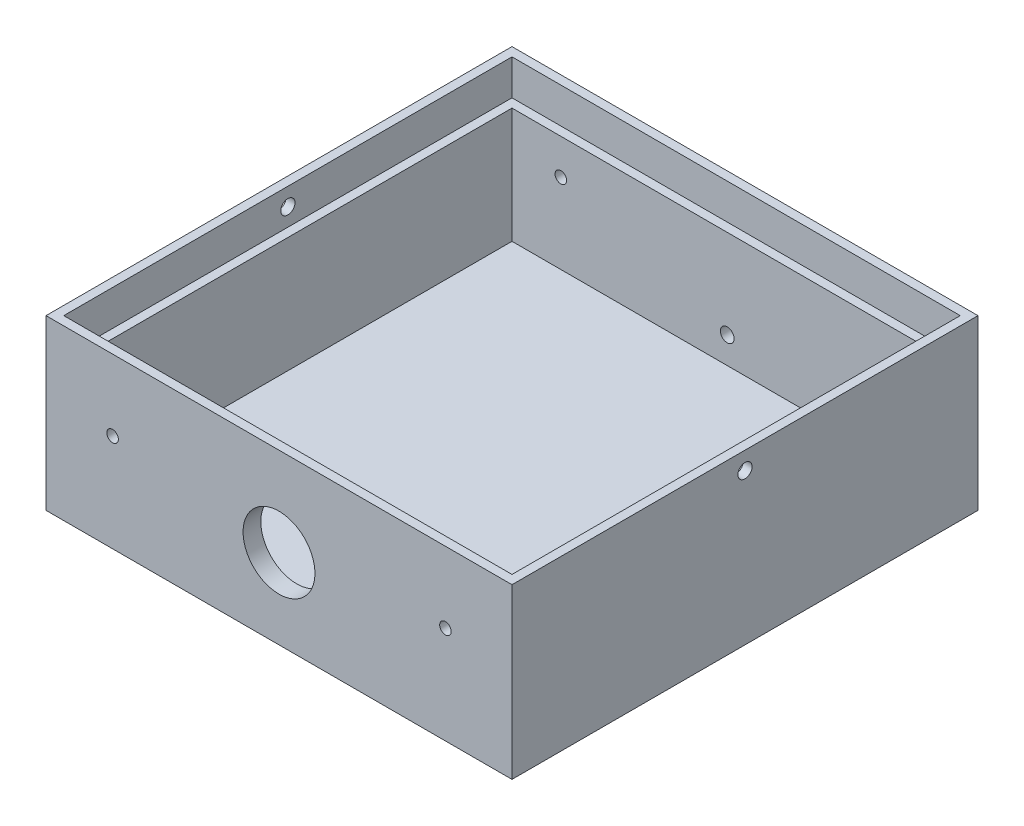
ISO-10303-21;
HEADER;
FILE_DESCRIPTION(('STEP AP214'),'2;1');
FILE_NAME('part.step','',(''),(''),'','','');
FILE_SCHEMA(('AUTOMOTIVE_DESIGN { 1 0 10303 214 1 1 1 1 }'));
ENDSEC;
DATA;
#1=APPLICATION_CONTEXT('core data for automotive mechanical design processes');
#2=APPLICATION_PROTOCOL_DEFINITION('international standard','automotive_design',2000,#1);
#3=PRODUCT_CONTEXT('',#1,'mechanical');
#4=PRODUCT('Part','Part','',(#3));
#5=PRODUCT_RELATED_PRODUCT_CATEGORY('part','',(#4));
#6=PRODUCT_DEFINITION_FORMATION('','',#4);
#7=PRODUCT_DEFINITION_CONTEXT('part definition',#1,'design');
#8=PRODUCT_DEFINITION('design','',#6,#7);
#9=PRODUCT_DEFINITION_SHAPE('','',#8);
#10=(LENGTH_UNIT() NAMED_UNIT(*) SI_UNIT(.MILLI.,.METRE.));
#11=(NAMED_UNIT(*) PLANE_ANGLE_UNIT() SI_UNIT($,.RADIAN.));
#12=(NAMED_UNIT(*) SI_UNIT($,.STERADIAN.) SOLID_ANGLE_UNIT());
#13=UNCERTAINTY_MEASURE_WITH_UNIT(LENGTH_MEASURE(1.E-05),#10,'distance_accuracy_value','');
#14=(GEOMETRIC_REPRESENTATION_CONTEXT(3) GLOBAL_UNCERTAINTY_ASSIGNED_CONTEXT((#13)) GLOBAL_UNIT_ASSIGNED_CONTEXT((#10,
#11,#12)) REPRESENTATION_CONTEXT('',''));
#15=CARTESIAN_POINT('',(0.,0.,0.));
#16=DIRECTION('',(0.,0.,1.));
#17=DIRECTION('',(1.,0.,0.));
#18=AXIS2_PLACEMENT_3D('',#15,#16,#17);
#19=CARTESIAN_POINT('',(52.5,38.,-52.5));
#20=DIRECTION('',(-1.,0.,0.));
#21=DIRECTION('',(0.,0.,1.));
#22=AXIS2_PLACEMENT_3D('',#19,#20,#21);
#23=PLANE('',#22);
#24=CARTESIAN_POINT('',(52.5,34.,0.));
#25=DIRECTION('',(1.,0.,0.));
#26=DIRECTION('',(0.,0.,-1.));
#27=AXIS2_PLACEMENT_3D('',#24,#25,#26);
#28=CIRCLE('',#27,1.6);
#29=CARTESIAN_POINT('',(52.5,34.,-1.6));
#30=VERTEX_POINT('',#29);
#31=EDGE_CURVE('E370',#30,#30,#28,.T.);
#32=ORIENTED_EDGE('',*,*,#31,.F.);
#33=EDGE_LOOP('',(#32));
#34=FACE_BOUND('',#33,.T.);
#35=DIRECTION('',(0.,0.,-1.));
#36=VECTOR('',#35,1.);
#37=CARTESIAN_POINT('',(52.5,0.,-52.5));
#38=LINE('',#37,#36);
#39=CARTESIAN_POINT('',(52.5,0.,52.5));
#40=VERTEX_POINT('',#39);
#41=CARTESIAN_POINT('',(52.5,0.,-52.5));
#42=VERTEX_POINT('',#41);
#43=EDGE_CURVE('E457',#40,#42,#38,.T.);
#44=ORIENTED_EDGE('',*,*,#43,.T.);
#45=DIRECTION('',(0.,-1.,0.));
#46=VECTOR('',#45,1.);
#47=CARTESIAN_POINT('',(52.5,38.,-52.5));
#48=LINE('',#47,#46);
#49=CARTESIAN_POINT('',(52.5,38.,-52.5));
#50=VERTEX_POINT('',#49);
#51=EDGE_CURVE('E48',#50,#42,#48,.T.);
#52=ORIENTED_EDGE('',*,*,#51,.F.);
#53=DIRECTION('',(0.,0.,-1.));
#54=VECTOR('',#53,1.);
#55=CARTESIAN_POINT('',(52.5,38.,-52.5));
#56=LINE('',#55,#54);
#57=CARTESIAN_POINT('',(52.5,38.,52.5));
#58=VERTEX_POINT('',#57);
#59=EDGE_CURVE('E469',#58,#50,#56,.T.);
#60=ORIENTED_EDGE('',*,*,#59,.F.);
#61=DIRECTION('',(0.,-1.,0.));
#62=VECTOR('',#61,1.);
#63=CARTESIAN_POINT('',(52.5,38.,52.5));
#64=LINE('',#63,#62);
#65=EDGE_CURVE('E483',#58,#40,#64,.T.);
#66=ORIENTED_EDGE('',*,*,#65,.T.);
#67=EDGE_LOOP('',(#44,#52,#60,#66));
#68=FACE_BOUND('',#67,.T.);
#69=ADVANCED_FACE('F39',(#34,#68),#23,.F.);
#70=CARTESIAN_POINT('',(-52.5,38.,-52.5));
#71=DIRECTION('',(0.,0.,1.));
#72=DIRECTION('',(1.,0.,0.));
#73=AXIS2_PLACEMENT_3D('',#70,#71,#72);
#74=PLANE('',#73);
#75=CARTESIAN_POINT('',(0.,10.,-52.5));
#76=DIRECTION('',(0.,0.,-1.));
#77=DIRECTION('',(-1.,0.,0.));
#78=AXIS2_PLACEMENT_3D('',#75,#76,#77);
#79=CIRCLE('',#78,1.55);
#80=CARTESIAN_POINT('',(-1.55,10.,-52.5));
#81=VERTEX_POINT('',#80);
#82=EDGE_CURVE('E531',#81,#81,#79,.T.);
#83=ORIENTED_EDGE('',*,*,#82,.F.);
#84=EDGE_LOOP('',(#83));
#85=FACE_BOUND('',#84,.T.);
#86=CARTESIAN_POINT('',(-37.5,22.,-52.5));
#87=DIRECTION('',(0.,0.,1.));
#88=DIRECTION('',(1.,0.,0.));
#89=AXIS2_PLACEMENT_3D('',#86,#87,#88);
#90=CIRCLE('',#89,1.3);
#91=CARTESIAN_POINT('',(-36.2,22.,-52.5));
#92=VERTEX_POINT('',#91);
#93=EDGE_CURVE('E515',#92,#92,#90,.T.);
#94=ORIENTED_EDGE('',*,*,#93,.T.);
#95=EDGE_LOOP('',(#94));
#96=FACE_BOUND('',#95,.T.);
#97=CARTESIAN_POINT('',(37.5,22.,-52.5));
#98=DIRECTION('',(0.,0.,1.));
#99=DIRECTION('',(-1.,0.,0.));
#100=AXIS2_PLACEMENT_3D('',#97,#98,#99);
#101=CIRCLE('',#100,1.3);
#102=CARTESIAN_POINT('',(36.2,22.,-52.5));
#103=VERTEX_POINT('',#102);
#104=EDGE_CURVE('E528',#103,#103,#101,.T.);
#105=ORIENTED_EDGE('',*,*,#104,.T.);
#106=EDGE_LOOP('',(#105));
#107=FACE_BOUND('',#106,.T.);
#108=DIRECTION('',(-1.,0.,0.));
#109=VECTOR('',#108,1.);
#110=CARTESIAN_POINT('',(-52.5,0.,-52.5));
#111=LINE('',#110,#109);
#112=CARTESIAN_POINT('',(-52.5,0.,-52.5));
#113=VERTEX_POINT('',#112);
#114=EDGE_CURVE('E487',#42,#113,#111,.T.);
#115=ORIENTED_EDGE('',*,*,#114,.T.);
#116=DIRECTION('',(0.,-1.,0.));
#117=VECTOR('',#116,1.);
#118=CARTESIAN_POINT('',(-52.5,38.,-52.5));
#119=LINE('',#118,#117);
#120=CARTESIAN_POINT('',(-52.5,38.,-52.5));
#121=VERTEX_POINT('',#120);
#122=EDGE_CURVE('E502',#121,#113,#119,.T.);
#123=ORIENTED_EDGE('',*,*,#122,.F.);
#124=DIRECTION('',(-1.,0.,0.));
#125=VECTOR('',#124,1.);
#126=CARTESIAN_POINT('',(-52.5,38.,-52.5));
#127=LINE('',#126,#125);
#128=EDGE_CURVE('E473',#50,#121,#127,.T.);
#129=ORIENTED_EDGE('',*,*,#128,.F.);
#130=ORIENTED_EDGE('',*,*,#51,.T.);
#131=EDGE_LOOP('',(#115,#123,#129,#130));
#132=FACE_BOUND('',#131,.T.);
#133=ADVANCED_FACE('F553',(#85,#96,#107,#132),#74,.F.);
#134=CARTESIAN_POINT('',(-52.5,38.,-52.5));
#135=DIRECTION('',(1.,0.,0.));
#136=DIRECTION('',(0.,0.,-1.));
#137=AXIS2_PLACEMENT_3D('',#134,#135,#136);
#138=PLANE('',#137);
#139=CARTESIAN_POINT('',(-52.5,34.,0.));
#140=DIRECTION('',(1.,0.,0.));
#141=DIRECTION('',(0.,0.,-1.));
#142=AXIS2_PLACEMENT_3D('',#139,#140,#141);
#143=CIRCLE('',#142,1.6);
#144=CARTESIAN_POINT('',(-52.5,34.,-1.59999999999999));
#145=VERTEX_POINT('',#144);
#146=EDGE_CURVE('E371',#145,#145,#143,.T.);
#147=ORIENTED_EDGE('',*,*,#146,.T.);
#148=EDGE_LOOP('',(#147));
#149=FACE_BOUND('',#148,.T.);
#150=DIRECTION('',(0.,0.,1.));
#151=VECTOR('',#150,1.);
#152=CARTESIAN_POINT('',(-52.5,0.,-52.5));
#153=LINE('',#152,#151);
#154=CARTESIAN_POINT('',(-52.5,0.,52.5));
#155=VERTEX_POINT('',#154);
#156=EDGE_CURVE('E490',#113,#155,#153,.T.);
#157=ORIENTED_EDGE('',*,*,#156,.T.);
#158=DIRECTION('',(0.,-1.,0.));
#159=VECTOR('',#158,1.);
#160=CARTESIAN_POINT('',(-52.5,38.,52.5));
#161=LINE('',#160,#159);
#162=CARTESIAN_POINT('',(-52.5,38.,52.5));
#163=VERTEX_POINT('',#162);
#164=EDGE_CURVE('E498',#163,#155,#161,.T.);
#165=ORIENTED_EDGE('',*,*,#164,.F.);
#166=DIRECTION('',(0.,0.,1.));
#167=VECTOR('',#166,1.);
#168=CARTESIAN_POINT('',(-52.5,38.,-52.5));
#169=LINE('',#168,#167);
#170=EDGE_CURVE('E477',#121,#163,#169,.T.);
#171=ORIENTED_EDGE('',*,*,#170,.F.);
#172=ORIENTED_EDGE('',*,*,#122,.T.);
#173=EDGE_LOOP('',(#157,#165,#171,#172));
#174=FACE_BOUND('',#173,.T.);
#175=ADVANCED_FACE('F555',(#149,#174),#138,.F.);
#176=CARTESIAN_POINT('',(-52.5,38.,52.5));
#177=DIRECTION('',(0.,0.,-1.));
#178=DIRECTION('',(-1.,0.,0.));
#179=AXIS2_PLACEMENT_3D('',#176,#177,#178);
#180=PLANE('',#179);
#181=CARTESIAN_POINT('',(-37.5,22.,52.5));
#182=DIRECTION('',(0.,0.,1.));
#183=DIRECTION('',(1.,0.,0.));
#184=AXIS2_PLACEMENT_3D('',#181,#182,#183);
#185=CIRCLE('',#184,1.3);
#186=CARTESIAN_POINT('',(-36.2,22.,52.5));
#187=VERTEX_POINT('',#186);
#188=EDGE_CURVE('E522',#187,#187,#185,.T.);
#189=ORIENTED_EDGE('',*,*,#188,.F.);
#190=EDGE_LOOP('',(#189));
#191=FACE_BOUND('',#190,.T.);
#192=CARTESIAN_POINT('',(37.5,22.,52.5));
#193=DIRECTION('',(0.,0.,1.));
#194=DIRECTION('',(-1.,0.,0.));
#195=AXIS2_PLACEMENT_3D('',#192,#193,#194);
#196=CIRCLE('',#195,1.3);
#197=CARTESIAN_POINT('',(36.2,22.,52.5));
#198=VERTEX_POINT('',#197);
#199=EDGE_CURVE('E537',#198,#198,#196,.T.);
#200=ORIENTED_EDGE('',*,*,#199,.F.);
#201=EDGE_LOOP('',(#200));
#202=FACE_BOUND('',#201,.T.);
#203=CARTESIAN_POINT('',(0.,18.,52.5));
#204=DIRECTION('',(0.,0.,-1.));
#205=DIRECTION('',(-1.,0.,0.));
#206=AXIS2_PLACEMENT_3D('',#203,#204,#205);
#207=CIRCLE('',#206,8.1);
#208=CARTESIAN_POINT('',(-8.1,18.,52.5));
#209=VERTEX_POINT('',#208);
#210=EDGE_CURVE('E366',#209,#209,#207,.F.);
#211=ORIENTED_EDGE('',*,*,#210,.F.);
#212=EDGE_LOOP('',(#211));
#213=FACE_BOUND('',#212,.T.);
#214=DIRECTION('',(1.,0.,0.));
#215=VECTOR('',#214,1.);
#216=CARTESIAN_POINT('',(-52.5,0.,52.5));
#217=LINE('',#216,#215);
#218=EDGE_CURVE('E474',#155,#40,#217,.T.);
#219=ORIENTED_EDGE('',*,*,#218,.T.);
#220=ORIENTED_EDGE('',*,*,#65,.F.);
#221=DIRECTION('',(1.,0.,0.));
#222=VECTOR('',#221,1.);
#223=CARTESIAN_POINT('',(-52.5,38.,52.5));
#224=LINE('',#223,#222);
#225=EDGE_CURVE('E480',#163,#58,#224,.T.);
#226=ORIENTED_EDGE('',*,*,#225,.F.);
#227=ORIENTED_EDGE('',*,*,#164,.T.);
#228=EDGE_LOOP('',(#219,#220,#226,#227));
#229=FACE_BOUND('',#228,.T.);
#230=ADVANCED_FACE('F571',(#191,#202,#213,#229),#180,.F.);
#231=CARTESIAN_POINT('',(0.,38.,0.));
#232=DIRECTION('',(0.,1.,0.));
#233=DIRECTION('',(0.,0.,1.));
#234=AXIS2_PLACEMENT_3D('',#231,#232,#233);
#235=PLANE('',#234);
#236=DIRECTION('',(0.,0.,-1.));
#237=VECTOR('',#236,1.);
#238=CARTESIAN_POINT('',(50.5,38.,-50.5));
#239=LINE('',#238,#237);
#240=CARTESIAN_POINT('',(50.5,38.,50.5));
#241=VERTEX_POINT('',#240);
#242=CARTESIAN_POINT('',(50.5,38.,-50.5));
#243=VERTEX_POINT('',#242);
#244=EDGE_CURVE('E383',#241,#243,#239,.T.);
#245=ORIENTED_EDGE('',*,*,#244,.F.);
#246=DIRECTION('',(1.,0.,0.));
#247=VECTOR('',#246,1.);
#248=CARTESIAN_POINT('',(-50.5,38.,50.5));
#249=LINE('',#248,#247);
#250=CARTESIAN_POINT('',(-50.5,38.,50.5));
#251=VERTEX_POINT('',#250);
#252=EDGE_CURVE('E389',#251,#241,#249,.T.);
#253=ORIENTED_EDGE('',*,*,#252,.F.);
#254=DIRECTION('',(0.,0.,1.));
#255=VECTOR('',#254,1.);
#256=CARTESIAN_POINT('',(-50.5,38.,-50.5));
#257=LINE('',#256,#255);
#258=CARTESIAN_POINT('',(-50.5,38.,-50.5));
#259=VERTEX_POINT('',#258);
#260=EDGE_CURVE('E408',#259,#251,#257,.T.);
#261=ORIENTED_EDGE('',*,*,#260,.F.);
#262=DIRECTION('',(-1.,0.,0.));
#263=VECTOR('',#262,1.);
#264=CARTESIAN_POINT('',(-50.5,38.,-50.5));
#265=LINE('',#264,#263);
#266=EDGE_CURVE('E404',#243,#259,#265,.T.);
#267=ORIENTED_EDGE('',*,*,#266,.F.);
#268=EDGE_LOOP('',(#245,#253,#261,#267));
#269=FACE_BOUND('',#268,.T.);
#270=ORIENTED_EDGE('',*,*,#59,.T.);
#271=ORIENTED_EDGE('',*,*,#128,.T.);
#272=ORIENTED_EDGE('',*,*,#170,.T.);
#273=ORIENTED_EDGE('',*,*,#225,.T.);
#274=EDGE_LOOP('',(#270,#271,#272,#273));
#275=FACE_BOUND('',#274,.T.);
#276=ADVANCED_FACE('F576',(#269,#275),#235,.T.);
#277=CARTESIAN_POINT('',(0.,0.,0.));
#278=DIRECTION('',(0.,1.,0.));
#279=DIRECTION('',(0.,0.,1.));
#280=AXIS2_PLACEMENT_3D('',#277,#278,#279);
#281=PLANE('',#280);
#282=DIRECTION('',(-1.,0.,0.));
#283=VECTOR('',#282,1.);
#284=CARTESIAN_POINT('',(5.,0.,10.));
#285=LINE('',#284,#283);
#286=CARTESIAN_POINT('',(5.,0.,10.));
#287=VERTEX_POINT('',#286);
#288=CARTESIAN_POINT('',(0.,0.,10.));
#289=VERTEX_POINT('',#288);
#290=EDGE_CURVE('E333',#287,#289,#285,.T.);
#291=ORIENTED_EDGE('',*,*,#290,.F.);
#292=DIRECTION('',(0.,0.,1.));
#293=VECTOR('',#292,1.);
#294=CARTESIAN_POINT('',(5.,0.,-10.));
#295=LINE('',#294,#293);
#296=CARTESIAN_POINT('',(5.,0.,-10.));
#297=VERTEX_POINT('',#296);
#298=EDGE_CURVE('E56',#297,#287,#295,.T.);
#299=ORIENTED_EDGE('',*,*,#298,.F.);
#300=DIRECTION('',(1.,0.,0.));
#301=VECTOR('',#300,1.);
#302=CARTESIAN_POINT('',(5.,0.,-10.));
#303=LINE('',#302,#301);
#304=CARTESIAN_POINT('',(0.,0.,-10.));
#305=VERTEX_POINT('',#304);
#306=EDGE_CURVE('E314',#305,#297,#303,.T.);
#307=ORIENTED_EDGE('',*,*,#306,.F.);
#308=CARTESIAN_POINT('',(0.,0.,-5.));
#309=DIRECTION('',(0.,-1.,0.));
#310=DIRECTION('',(0.,0.,-1.));
#311=AXIS2_PLACEMENT_3D('',#308,#309,#310);
#312=CIRCLE('',#311,5.);
#313=CARTESIAN_POINT('',(0.,0.,0.));
#314=VERTEX_POINT('',#313);
#315=EDGE_CURVE('E341',#314,#305,#312,.T.);
#316=ORIENTED_EDGE('',*,*,#315,.F.);
#317=CARTESIAN_POINT('',(0.,0.,5.));
#318=DIRECTION('',(0.,-1.,0.));
#319=DIRECTION('',(0.,0.,-1.));
#320=AXIS2_PLACEMENT_3D('',#317,#318,#319);
#321=CIRCLE('',#320,5.);
#322=EDGE_CURVE('E337',#289,#314,#321,.T.);
#323=ORIENTED_EDGE('',*,*,#322,.F.);
#324=EDGE_LOOP('',(#291,#299,#307,#316,#323));
#325=FACE_BOUND('',#324,.T.);
#326=ORIENTED_EDGE('',*,*,#43,.F.);
#327=ORIENTED_EDGE('',*,*,#218,.F.);
#328=ORIENTED_EDGE('',*,*,#156,.F.);
#329=ORIENTED_EDGE('',*,*,#114,.F.);
#330=EDGE_LOOP('',(#326,#327,#328,#329));
#331=FACE_BOUND('',#330,.T.);
#332=ADVANCED_FACE('F568',(#325,#331),#281,.F.);
#333=CARTESIAN_POINT('',(0.,30.,0.));
#334=DIRECTION('',(0.,1.,0.));
#335=DIRECTION('',(0.,0.,1.));
#336=AXIS2_PLACEMENT_3D('',#333,#334,#335);
#337=PLANE('',#336);
#338=DIRECTION('',(0.,0.,-1.));
#339=VECTOR('',#338,1.);
#340=CARTESIAN_POINT('',(50.5,30.,-50.5));
#341=LINE('',#340,#339);
#342=CARTESIAN_POINT('',(50.5,30.,50.5));
#343=VERTEX_POINT('',#342);
#344=CARTESIAN_POINT('',(50.5,30.,-50.5));
#345=VERTEX_POINT('',#344);
#346=EDGE_CURVE('E384',#343,#345,#341,.T.);
#347=ORIENTED_EDGE('',*,*,#346,.T.);
#348=DIRECTION('',(-1.,0.,0.));
#349=VECTOR('',#348,1.);
#350=CARTESIAN_POINT('',(-50.5,30.,-50.5));
#351=LINE('',#350,#349);
#352=CARTESIAN_POINT('',(-50.5,30.,-50.5));
#353=VERTEX_POINT('',#352);
#354=EDGE_CURVE('E388',#345,#353,#351,.T.);
#355=ORIENTED_EDGE('',*,*,#354,.T.);
#356=DIRECTION('',(0.,0.,1.));
#357=VECTOR('',#356,1.);
#358=CARTESIAN_POINT('',(-50.5,30.,-50.5));
#359=LINE('',#358,#357);
#360=CARTESIAN_POINT('',(-50.5,30.,50.5));
#361=VERTEX_POINT('',#360);
#362=EDGE_CURVE('E393',#353,#361,#359,.T.);
#363=ORIENTED_EDGE('',*,*,#362,.T.);
#364=DIRECTION('',(1.,0.,0.));
#365=VECTOR('',#364,1.);
#366=CARTESIAN_POINT('',(-50.5,30.,50.5));
#367=LINE('',#366,#365);
#368=EDGE_CURVE('E397',#361,#343,#367,.T.);
#369=ORIENTED_EDGE('',*,*,#368,.T.);
#370=EDGE_LOOP('',(#347,#355,#363,#369));
#371=FACE_BOUND('',#370,.T.);
#372=DIRECTION('',(0.,0.,1.));
#373=VECTOR('',#372,1.);
#374=CARTESIAN_POINT('',(48.5,30.,-48.5));
#375=LINE('',#374,#373);
#376=CARTESIAN_POINT('',(48.5,30.,-48.5));
#377=VERTEX_POINT('',#376);
#378=CARTESIAN_POINT('',(48.5,30.,48.5));
#379=VERTEX_POINT('',#378);
#380=EDGE_CURVE('E433',#377,#379,#375,.T.);
#381=ORIENTED_EDGE('',*,*,#380,.T.);
#382=DIRECTION('',(-1.,0.,0.));
#383=VECTOR('',#382,1.);
#384=CARTESIAN_POINT('',(-48.5,30.,48.5));
#385=LINE('',#384,#383);
#386=CARTESIAN_POINT('',(-48.5,30.,48.5));
#387=VERTEX_POINT('',#386);
#388=EDGE_CURVE('E430',#379,#387,#385,.T.);
#389=ORIENTED_EDGE('',*,*,#388,.T.);
#390=DIRECTION('',(0.,0.,-1.));
#391=VECTOR('',#390,1.);
#392=CARTESIAN_POINT('',(-48.5,30.,-48.5));
#393=LINE('',#392,#391);
#394=CARTESIAN_POINT('',(-48.5,30.,-48.5));
#395=VERTEX_POINT('',#394);
#396=EDGE_CURVE('E418',#387,#395,#393,.T.);
#397=ORIENTED_EDGE('',*,*,#396,.T.);
#398=DIRECTION('',(1.,0.,0.));
#399=VECTOR('',#398,1.);
#400=CARTESIAN_POINT('',(-48.5,30.,-48.5));
#401=LINE('',#400,#399);
#402=EDGE_CURVE('E11',#395,#377,#401,.T.);
#403=ORIENTED_EDGE('',*,*,#402,.T.);
#404=EDGE_LOOP('',(#381,#389,#397,#403));
#405=FACE_BOUND('',#404,.T.);
#406=ADVANCED_FACE('F584',(#371,#405),#337,.T.);
#407=CARTESIAN_POINT('',(50.5,30.,-50.5));
#408=DIRECTION('',(1.,0.,0.));
#409=DIRECTION('',(0.,0.,-1.));
#410=AXIS2_PLACEMENT_3D('',#407,#408,#409);
#411=PLANE('',#410);
#412=CARTESIAN_POINT('',(50.5,34.,0.));
#413=DIRECTION('',(1.,0.,0.));
#414=DIRECTION('',(0.,0.,-1.));
#415=AXIS2_PLACEMENT_3D('',#412,#413,#414);
#416=CIRCLE('',#415,1.6);
#417=CARTESIAN_POINT('',(50.5,34.,-1.6));
#418=VERTEX_POINT('',#417);
#419=EDGE_CURVE('E379',#418,#418,#416,.T.);
#420=ORIENTED_EDGE('',*,*,#419,.T.);
#421=EDGE_LOOP('',(#420));
#422=FACE_BOUND('',#421,.T.);
#423=ORIENTED_EDGE('',*,*,#244,.T.);
#424=DIRECTION('',(0.,1.,0.));
#425=VECTOR('',#424,1.);
#426=CARTESIAN_POINT('',(50.5,30.,-50.5));
#427=LINE('',#426,#425);
#428=EDGE_CURVE('E401',#345,#243,#427,.T.);
#429=ORIENTED_EDGE('',*,*,#428,.F.);
#430=ORIENTED_EDGE('',*,*,#346,.F.);
#431=DIRECTION('',(0.,1.,0.));
#432=VECTOR('',#431,1.);
#433=CARTESIAN_POINT('',(50.5,30.,50.5));
#434=LINE('',#433,#432);
#435=EDGE_CURVE('E415',#343,#241,#434,.T.);
#436=ORIENTED_EDGE('',*,*,#435,.T.);
#437=EDGE_LOOP('',(#423,#429,#430,#436));
#438=FACE_BOUND('',#437,.T.);
#439=ADVANCED_FACE('F607',(#422,#438),#411,.F.);
#440=CARTESIAN_POINT('',(-50.5,30.,50.5));
#441=DIRECTION('',(0.,0.,1.));
#442=DIRECTION('',(1.,0.,0.));
#443=AXIS2_PLACEMENT_3D('',#440,#441,#442);
#444=PLANE('',#443);
#445=ORIENTED_EDGE('',*,*,#252,.T.);
#446=ORIENTED_EDGE('',*,*,#435,.F.);
#447=ORIENTED_EDGE('',*,*,#368,.F.);
#448=DIRECTION('',(0.,1.,0.));
#449=VECTOR('',#448,1.);
#450=CARTESIAN_POINT('',(-50.5,30.,50.5));
#451=LINE('',#450,#449);
#452=EDGE_CURVE('E419',#361,#251,#451,.T.);
#453=ORIENTED_EDGE('',*,*,#452,.T.);
#454=EDGE_LOOP('',(#445,#446,#447,#453));
#455=FACE_BOUND('',#454,.T.);
#456=ADVANCED_FACE('F610',(#455),#444,.F.);
#457=CARTESIAN_POINT('',(-50.5,30.,-50.5));
#458=DIRECTION('',(-1.,0.,0.));
#459=DIRECTION('',(0.,0.,1.));
#460=AXIS2_PLACEMENT_3D('',#457,#458,#459);
#461=PLANE('',#460);
#462=CARTESIAN_POINT('',(-50.5,34.,0.));
#463=DIRECTION('',(-1.,0.,0.));
#464=DIRECTION('',(0.,0.,1.));
#465=AXIS2_PLACEMENT_3D('',#462,#463,#464);
#466=CIRCLE('',#465,1.6);
#467=CARTESIAN_POINT('',(-50.5,34.,1.6));
#468=VERTEX_POINT('',#467);
#469=EDGE_CURVE('E375',#468,#468,#466,.T.);
#470=ORIENTED_EDGE('',*,*,#469,.T.);
#471=EDGE_LOOP('',(#470));
#472=FACE_BOUND('',#471,.T.);
#473=ORIENTED_EDGE('',*,*,#260,.T.);
#474=ORIENTED_EDGE('',*,*,#452,.F.);
#475=ORIENTED_EDGE('',*,*,#362,.F.);
#476=DIRECTION('',(0.,1.,0.));
#477=VECTOR('',#476,1.);
#478=CARTESIAN_POINT('',(-50.5,30.,-50.5));
#479=LINE('',#478,#477);
#480=EDGE_CURVE('E422',#353,#259,#479,.T.);
#481=ORIENTED_EDGE('',*,*,#480,.T.);
#482=EDGE_LOOP('',(#473,#474,#475,#481));
#483=FACE_BOUND('',#482,.T.);
#484=ADVANCED_FACE('F620',(#472,#483),#461,.F.);
#485=CARTESIAN_POINT('',(-50.5,30.,-50.5));
#486=DIRECTION('',(0.,0.,-1.));
#487=DIRECTION('',(-1.,0.,0.));
#488=AXIS2_PLACEMENT_3D('',#485,#486,#487);
#489=PLANE('',#488);
#490=ORIENTED_EDGE('',*,*,#266,.T.);
#491=ORIENTED_EDGE('',*,*,#480,.F.);
#492=ORIENTED_EDGE('',*,*,#354,.F.);
#493=ORIENTED_EDGE('',*,*,#428,.T.);
#494=EDGE_LOOP('',(#490,#491,#492,#493));
#495=FACE_BOUND('',#494,.T.);
#496=ADVANCED_FACE('F617',(#495),#489,.F.);
#497=CARTESIAN_POINT('',(0.,4.,0.));
#498=DIRECTION('',(0.,1.,0.));
#499=DIRECTION('',(0.,0.,1.));
#500=AXIS2_PLACEMENT_3D('',#497,#498,#499);
#501=PLANE('',#500);
#502=DIRECTION('',(0.,0.,-1.));
#503=VECTOR('',#502,1.);
#504=CARTESIAN_POINT('',(48.5,4.,-48.5));
#505=LINE('',#504,#503);
#506=CARTESIAN_POINT('',(48.5,4.,48.5));
#507=VERTEX_POINT('',#506);
#508=CARTESIAN_POINT('',(48.5,4.,-48.5));
#509=VERTEX_POINT('',#508);
#510=EDGE_CURVE('E436',#507,#509,#505,.T.);
#511=ORIENTED_EDGE('',*,*,#510,.T.);
#512=DIRECTION('',(-1.,0.,0.));
#513=VECTOR('',#512,1.);
#514=CARTESIAN_POINT('',(-48.5,4.,-48.5));
#515=LINE('',#514,#513);
#516=CARTESIAN_POINT('',(-48.5,4.,-48.5));
#517=VERTEX_POINT('',#516);
#518=EDGE_CURVE('E440',#509,#517,#515,.T.);
#519=ORIENTED_EDGE('',*,*,#518,.T.);
#520=DIRECTION('',(0.,0.,1.));
#521=VECTOR('',#520,1.);
#522=CARTESIAN_POINT('',(-48.5,4.,-48.5));
#523=LINE('',#522,#521);
#524=CARTESIAN_POINT('',(-48.5,4.,48.5));
#525=VERTEX_POINT('',#524);
#526=EDGE_CURVE('E444',#517,#525,#523,.T.);
#527=ORIENTED_EDGE('',*,*,#526,.T.);
#528=DIRECTION('',(1.,0.,0.));
#529=VECTOR('',#528,1.);
#530=CARTESIAN_POINT('',(-48.5,4.,48.5));
#531=LINE('',#530,#529);
#532=EDGE_CURVE('E448',#525,#507,#531,.T.);
#533=ORIENTED_EDGE('',*,*,#532,.T.);
#534=EDGE_LOOP('',(#511,#519,#527,#533));
#535=FACE_BOUND('',#534,.T.);
#536=ADVANCED_FACE('F636',(#535),#501,.T.);
#537=CARTESIAN_POINT('',(-48.5,4.,-48.5));
#538=DIRECTION('',(0.,0.,-1.));
#539=DIRECTION('',(-1.,0.,0.));
#540=AXIS2_PLACEMENT_3D('',#537,#538,#539);
#541=PLANE('',#540);
#542=CARTESIAN_POINT('',(0.,10.,-48.5));
#543=DIRECTION('',(0.,0.,-1.));
#544=DIRECTION('',(-1.,0.,0.));
#545=AXIS2_PLACEMENT_3D('',#542,#543,#544);
#546=CIRCLE('',#545,1.55);
#547=CARTESIAN_POINT('',(-1.55,10.,-48.5));
#548=VERTEX_POINT('',#547);
#549=EDGE_CURVE('E540',#548,#548,#546,.F.);
#550=ORIENTED_EDGE('',*,*,#549,.F.);
#551=EDGE_LOOP('',(#550));
#552=FACE_BOUND('',#551,.T.);
#553=CARTESIAN_POINT('',(-37.5,22.,-48.5));
#554=DIRECTION('',(0.,0.,-1.));
#555=DIRECTION('',(-1.,0.,0.));
#556=AXIS2_PLACEMENT_3D('',#553,#554,#555);
#557=CIRCLE('',#556,1.3);
#558=CARTESIAN_POINT('',(-38.8,22.,-48.5));
#559=VERTEX_POINT('',#558);
#560=EDGE_CURVE('E245',#559,#559,#557,.T.);
#561=ORIENTED_EDGE('',*,*,#560,.T.);
#562=EDGE_LOOP('',(#561));
#563=FACE_BOUND('',#562,.T.);
#564=CARTESIAN_POINT('',(37.5,22.,-48.5));
#565=DIRECTION('',(0.,0.,-1.));
#566=DIRECTION('',(-1.,0.,0.));
#567=AXIS2_PLACEMENT_3D('',#564,#565,#566);
#568=CIRCLE('',#567,1.3);
#569=CARTESIAN_POINT('',(36.2,22.,-48.5));
#570=VERTEX_POINT('',#569);
#571=EDGE_CURVE('E514',#570,#570,#568,.T.);
#572=ORIENTED_EDGE('',*,*,#571,.T.);
#573=EDGE_LOOP('',(#572));
#574=FACE_BOUND('',#573,.T.);
#575=ORIENTED_EDGE('',*,*,#402,.F.);
#576=DIRECTION('',(0.,1.,0.));
#577=VECTOR('',#576,1.);
#578=CARTESIAN_POINT('',(-48.5,4.,-48.5));
#579=LINE('',#578,#577);
#580=EDGE_CURVE('E462',#517,#395,#579,.T.);
#581=ORIENTED_EDGE('',*,*,#580,.F.);
#582=ORIENTED_EDGE('',*,*,#518,.F.);
#583=DIRECTION('',(0.,1.,0.));
#584=VECTOR('',#583,1.);
#585=CARTESIAN_POINT('',(48.5,4.,-48.5));
#586=LINE('',#585,#584);
#587=EDGE_CURVE('E452',#509,#377,#586,.T.);
#588=ORIENTED_EDGE('',*,*,#587,.T.);
#589=EDGE_LOOP('',(#575,#581,#582,#588));
#590=FACE_BOUND('',#589,.T.);
#591=ADVANCED_FACE('F640',(#552,#563,#574,#590),#541,.F.);
#592=CARTESIAN_POINT('',(-48.5,4.,-48.5));
#593=DIRECTION('',(-1.,0.,0.));
#594=DIRECTION('',(0.,0.,1.));
#595=AXIS2_PLACEMENT_3D('',#592,#593,#594);
#596=PLANE('',#595);
#597=ORIENTED_EDGE('',*,*,#396,.F.);
#598=DIRECTION('',(0.,1.,0.));
#599=VECTOR('',#598,1.);
#600=CARTESIAN_POINT('',(-48.5,4.,48.5));
#601=LINE('',#600,#599);
#602=EDGE_CURVE('E458',#525,#387,#601,.T.);
#603=ORIENTED_EDGE('',*,*,#602,.F.);
#604=ORIENTED_EDGE('',*,*,#526,.F.);
#605=ORIENTED_EDGE('',*,*,#580,.T.);
#606=EDGE_LOOP('',(#597,#603,#604,#605));
#607=FACE_BOUND('',#606,.T.);
#608=ADVANCED_FACE('F646',(#607),#596,.F.);
#609=CARTESIAN_POINT('',(-48.5,4.,48.5));
#610=DIRECTION('',(0.,0.,1.));
#611=DIRECTION('',(1.,0.,0.));
#612=AXIS2_PLACEMENT_3D('',#609,#610,#611);
#613=PLANE('',#612);
#614=CARTESIAN_POINT('',(-37.5,22.,48.5));
#615=DIRECTION('',(0.,0.,1.));
#616=DIRECTION('',(1.,0.,0.));
#617=AXIS2_PLACEMENT_3D('',#614,#615,#616);
#618=CIRCLE('',#617,1.3);
#619=CARTESIAN_POINT('',(-36.2,22.,48.5));
#620=VERTEX_POINT('',#619);
#621=EDGE_CURVE('E42',#620,#620,#618,.T.);
#622=ORIENTED_EDGE('',*,*,#621,.T.);
#623=EDGE_LOOP('',(#622));
#624=FACE_BOUND('',#623,.T.);
#625=CARTESIAN_POINT('',(37.5,22.,48.5));
#626=DIRECTION('',(0.,0.,1.));
#627=DIRECTION('',(1.,0.,0.));
#628=AXIS2_PLACEMENT_3D('',#625,#626,#627);
#629=CIRCLE('',#628,1.3);
#630=CARTESIAN_POINT('',(38.8,22.,48.5));
#631=VERTEX_POINT('',#630);
#632=EDGE_CURVE('E511',#631,#631,#629,.T.);
#633=ORIENTED_EDGE('',*,*,#632,.T.);
#634=EDGE_LOOP('',(#633));
#635=FACE_BOUND('',#634,.T.);
#636=CARTESIAN_POINT('',(0.,18.,48.5));
#637=DIRECTION('',(0.,0.,-1.));
#638=DIRECTION('',(-1.,0.,0.));
#639=AXIS2_PLACEMENT_3D('',#636,#637,#638);
#640=CIRCLE('',#639,8.1);
#641=CARTESIAN_POINT('',(-8.1,18.,48.5));
#642=VERTEX_POINT('',#641);
#643=EDGE_CURVE('E351',#642,#642,#640,.T.);
#644=ORIENTED_EDGE('',*,*,#643,.F.);
#645=EDGE_LOOP('',(#644));
#646=FACE_BOUND('',#645,.T.);
#647=ORIENTED_EDGE('',*,*,#388,.F.);
#648=DIRECTION('',(0.,1.,0.));
#649=VECTOR('',#648,1.);
#650=CARTESIAN_POINT('',(48.5,4.,48.5));
#651=LINE('',#650,#649);
#652=EDGE_CURVE('E453',#507,#379,#651,.T.);
#653=ORIENTED_EDGE('',*,*,#652,.F.);
#654=ORIENTED_EDGE('',*,*,#532,.F.);
#655=ORIENTED_EDGE('',*,*,#602,.T.);
#656=EDGE_LOOP('',(#647,#653,#654,#655));
#657=FACE_BOUND('',#656,.T.);
#658=ADVANCED_FACE('F642',(#624,#635,#646,#657),#613,.F.);
#659=CARTESIAN_POINT('',(48.5,4.,-48.5));
#660=DIRECTION('',(1.,0.,0.));
#661=DIRECTION('',(0.,0.,-1.));
#662=AXIS2_PLACEMENT_3D('',#659,#660,#661);
#663=PLANE('',#662);
#664=ORIENTED_EDGE('',*,*,#380,.F.);
#665=ORIENTED_EDGE('',*,*,#587,.F.);
#666=ORIENTED_EDGE('',*,*,#510,.F.);
#667=ORIENTED_EDGE('',*,*,#652,.T.);
#668=EDGE_LOOP('',(#664,#665,#666,#667));
#669=FACE_BOUND('',#668,.T.);
#670=ADVANCED_FACE('F645',(#669),#663,.F.);
#671=CARTESIAN_POINT('',(-52.5,34.,0.));
#672=DIRECTION('',(1.,0.,0.));
#673=DIRECTION('',(0.,0.,-1.));
#674=AXIS2_PLACEMENT_3D('',#671,#672,#673);
#675=CYLINDRICAL_SURFACE('',#674,1.6);
#676=ORIENTED_EDGE('',*,*,#146,.F.);
#677=EDGE_LOOP('',(#676));
#678=FACE_BOUND('',#677,.T.);
#679=ORIENTED_EDGE('',*,*,#469,.F.);
#680=EDGE_LOOP('',(#679));
#681=FACE_BOUND('',#680,.T.);
#682=ADVANCED_FACE('F603',(#678,#681),#675,.F.);
#683=ORIENTED_EDGE('',*,*,#31,.T.);
#684=EDGE_LOOP('',(#683));
#685=FACE_BOUND('',#684,.T.);
#686=ORIENTED_EDGE('',*,*,#419,.F.);
#687=EDGE_LOOP('',(#686));
#688=FACE_BOUND('',#687,.T.);
#689=ADVANCED_FACE('F599',(#685,#688),#675,.F.);
#690=CARTESIAN_POINT('',(0.,18.,52.501));
#691=DIRECTION('',(0.,0.,-1.));
#692=DIRECTION('',(-1.,0.,0.));
#693=AXIS2_PLACEMENT_3D('',#690,#691,#692);
#694=CYLINDRICAL_SURFACE('',#693,8.1);
#695=ORIENTED_EDGE('',*,*,#643,.T.);
#696=EDGE_LOOP('',(#695));
#697=FACE_BOUND('',#696,.T.);
#698=ORIENTED_EDGE('',*,*,#210,.T.);
#699=EDGE_LOOP('',(#698));
#700=FACE_BOUND('',#699,.T.);
#701=ADVANCED_FACE('F602',(#697,#700),#694,.F.);
#702=CARTESIAN_POINT('',(5.,1.,-10.));
#703=DIRECTION('',(1.,0.,0.));
#704=DIRECTION('',(0.,0.,-1.));
#705=AXIS2_PLACEMENT_3D('',#702,#703,#704);
#706=PLANE('',#705);
#707=ORIENTED_EDGE('',*,*,#298,.T.);
#708=DIRECTION('',(0.,-1.,0.));
#709=VECTOR('',#708,1.);
#710=CARTESIAN_POINT('',(5.,1.,10.));
#711=LINE('',#710,#709);
#712=CARTESIAN_POINT('',(5.,1.,10.));
#713=VERTEX_POINT('',#712);
#714=EDGE_CURVE('E330',#713,#287,#711,.T.);
#715=ORIENTED_EDGE('',*,*,#714,.F.);
#716=DIRECTION('',(0.,0.,1.));
#717=VECTOR('',#716,1.);
#718=CARTESIAN_POINT('',(5.,1.,-10.));
#719=LINE('',#718,#717);
#720=CARTESIAN_POINT('',(5.,1.,-10.));
#721=VERTEX_POINT('',#720);
#722=EDGE_CURVE('E309',#721,#713,#719,.T.);
#723=ORIENTED_EDGE('',*,*,#722,.F.);
#724=DIRECTION('',(0.,-1.,0.));
#725=VECTOR('',#724,1.);
#726=CARTESIAN_POINT('',(5.,1.,-10.));
#727=LINE('',#726,#725);
#728=EDGE_CURVE('E348',#721,#297,#727,.T.);
#729=ORIENTED_EDGE('',*,*,#728,.T.);
#730=EDGE_LOOP('',(#707,#715,#723,#729));
#731=FACE_BOUND('',#730,.T.);
#732=ADVANCED_FACE('F710',(#731),#706,.F.);
#733=CARTESIAN_POINT('',(5.,1.,-10.));
#734=DIRECTION('',(0.,0.,-1.));
#735=DIRECTION('',(-1.,0.,0.));
#736=AXIS2_PLACEMENT_3D('',#733,#734,#735);
#737=PLANE('',#736);
#738=ORIENTED_EDGE('',*,*,#306,.T.);
#739=ORIENTED_EDGE('',*,*,#728,.F.);
#740=DIRECTION('',(1.,0.,0.));
#741=VECTOR('',#740,1.);
#742=CARTESIAN_POINT('',(5.,1.,-10.));
#743=LINE('',#742,#741);
#744=CARTESIAN_POINT('',(0.,1.,-10.));
#745=VERTEX_POINT('',#744);
#746=EDGE_CURVE('E326',#745,#721,#743,.T.);
#747=ORIENTED_EDGE('',*,*,#746,.F.);
#748=DIRECTION('',(0.,-1.,0.));
#749=VECTOR('',#748,1.);
#750=CARTESIAN_POINT('',(0.,1.,-10.));
#751=LINE('',#750,#749);
#752=EDGE_CURVE('E352',#745,#305,#751,.T.);
#753=ORIENTED_EDGE('',*,*,#752,.T.);
#754=EDGE_LOOP('',(#738,#739,#747,#753));
#755=FACE_BOUND('',#754,.T.);
#756=ADVANCED_FACE('F728',(#755),#737,.F.);
#757=CARTESIAN_POINT('',(0.,1.,-5.));
#758=DIRECTION('',(0.,-1.,0.));
#759=DIRECTION('',(0.,0.,-1.));
#760=AXIS2_PLACEMENT_3D('',#757,#758,#759);
#761=CYLINDRICAL_SURFACE('',#760,5.);
#762=ORIENTED_EDGE('',*,*,#315,.T.);
#763=ORIENTED_EDGE('',*,*,#752,.F.);
#764=CARTESIAN_POINT('',(0.,1.,-5.));
#765=DIRECTION('',(0.,-1.,0.));
#766=DIRECTION('',(0.,0.,-1.));
#767=AXIS2_PLACEMENT_3D('',#764,#765,#766);
#768=CIRCLE('',#767,5.);
#769=CARTESIAN_POINT('',(0.,1.,0.));
#770=VERTEX_POINT('',#769);
#771=EDGE_CURVE('E322',#770,#745,#768,.T.);
#772=ORIENTED_EDGE('',*,*,#771,.F.);
#773=DIRECTION('',(0.,-1.,0.));
#774=VECTOR('',#773,1.);
#775=CARTESIAN_POINT('',(0.,1.,0.));
#776=LINE('',#775,#774);
#777=EDGE_CURVE('E355',#770,#314,#776,.T.);
#778=ORIENTED_EDGE('',*,*,#777,.T.);
#779=EDGE_LOOP('',(#762,#763,#772,#778));
#780=FACE_BOUND('',#779,.T.);
#781=ADVANCED_FACE('F738',(#780),#761,.F.);
#782=CARTESIAN_POINT('',(0.,1.,5.));
#783=DIRECTION('',(0.,-1.,0.));
#784=DIRECTION('',(0.,0.,-1.));
#785=AXIS2_PLACEMENT_3D('',#782,#783,#784);
#786=CYLINDRICAL_SURFACE('',#785,5.);
#787=ORIENTED_EDGE('',*,*,#322,.T.);
#788=ORIENTED_EDGE('',*,*,#777,.F.);
#789=CARTESIAN_POINT('',(0.,1.,5.));
#790=DIRECTION('',(0.,-1.,0.));
#791=DIRECTION('',(0.,0.,-1.));
#792=AXIS2_PLACEMENT_3D('',#789,#790,#791);
#793=CIRCLE('',#792,5.);
#794=CARTESIAN_POINT('',(0.,1.,10.));
#795=VERTEX_POINT('',#794);
#796=EDGE_CURVE('E318',#795,#770,#793,.T.);
#797=ORIENTED_EDGE('',*,*,#796,.F.);
#798=DIRECTION('',(0.,-1.,0.));
#799=VECTOR('',#798,1.);
#800=CARTESIAN_POINT('',(0.,1.,10.));
#801=LINE('',#800,#799);
#802=EDGE_CURVE('E358',#795,#289,#801,.T.);
#803=ORIENTED_EDGE('',*,*,#802,.T.);
#804=EDGE_LOOP('',(#787,#788,#797,#803));
#805=FACE_BOUND('',#804,.T.);
#806=ADVANCED_FACE('F748',(#805),#786,.F.);
#807=CARTESIAN_POINT('',(5.,1.,10.));
#808=DIRECTION('',(0.,0.,1.));
#809=DIRECTION('',(1.,0.,0.));
#810=AXIS2_PLACEMENT_3D('',#807,#808,#809);
#811=PLANE('',#810);
#812=ORIENTED_EDGE('',*,*,#290,.T.);
#813=ORIENTED_EDGE('',*,*,#802,.F.);
#814=DIRECTION('',(-1.,0.,0.));
#815=VECTOR('',#814,1.);
#816=CARTESIAN_POINT('',(5.,1.,10.));
#817=LINE('',#816,#815);
#818=EDGE_CURVE('E313',#713,#795,#817,.T.);
#819=ORIENTED_EDGE('',*,*,#818,.F.);
#820=ORIENTED_EDGE('',*,*,#714,.T.);
#821=EDGE_LOOP('',(#812,#813,#819,#820));
#822=FACE_BOUND('',#821,.T.);
#823=ADVANCED_FACE('F758',(#822),#811,.F.);
#824=CARTESIAN_POINT('',(0.,1.,5.));
#825=DIRECTION('',(0.,-1.,0.));
#826=DIRECTION('',(0.,0.,-1.));
#827=AXIS2_PLACEMENT_3D('',#824,#825,#826);
#828=PLANE('',#827);
#829=DIRECTION('',(-1.,0.,0.));
#830=VECTOR('',#829,1.);
#831=CARTESIAN_POINT('',(0.,1.,7.));
#832=LINE('',#831,#830);
#833=CARTESIAN_POINT('',(2.,1.,7.));
#834=VERTEX_POINT('',#833);
#835=CARTESIAN_POINT('',(0.,1.,7.));
#836=VERTEX_POINT('',#835);
#837=EDGE_CURVE('E221',#834,#836,#832,.T.);
#838=ORIENTED_EDGE('',*,*,#837,.F.);
#839=DIRECTION('',(0.,0.,1.));
#840=VECTOR('',#839,1.);
#841=CARTESIAN_POINT('',(2.,1.,3.));
#842=LINE('',#841,#840);
#843=CARTESIAN_POINT('',(2.,1.,3.));
#844=VERTEX_POINT('',#843);
#845=EDGE_CURVE('E231',#844,#834,#842,.T.);
#846=ORIENTED_EDGE('',*,*,#845,.F.);
#847=DIRECTION('',(1.,0.,0.));
#848=VECTOR('',#847,1.);
#849=CARTESIAN_POINT('',(0.,1.,3.));
#850=LINE('',#849,#848);
#851=CARTESIAN_POINT('',(0.,1.,3.));
#852=VERTEX_POINT('',#851);
#853=EDGE_CURVE('E212',#852,#844,#850,.T.);
#854=ORIENTED_EDGE('',*,*,#853,.F.);
#855=CARTESIAN_POINT('',(0.,1.,5.));
#856=DIRECTION('',(0.,-1.,0.));
#857=DIRECTION('',(0.,0.,-1.));
#858=AXIS2_PLACEMENT_3D('',#855,#856,#857);
#859=CIRCLE('',#858,2.);
#860=EDGE_CURVE('E228',#836,#852,#859,.T.);
#861=ORIENTED_EDGE('',*,*,#860,.F.);
#862=EDGE_LOOP('',(#838,#846,#854,#861));
#863=FACE_BOUND('',#862,.T.);
#864=DIRECTION('',(-1.,0.,0.));
#865=VECTOR('',#864,1.);
#866=CARTESIAN_POINT('',(0.,1.,-3.));
#867=LINE('',#866,#865);
#868=CARTESIAN_POINT('',(2.,1.,-3.));
#869=VERTEX_POINT('',#868);
#870=CARTESIAN_POINT('',(0.,1.,-3.));
#871=VERTEX_POINT('',#870);
#872=EDGE_CURVE('E281',#869,#871,#867,.T.);
#873=ORIENTED_EDGE('',*,*,#872,.F.);
#874=DIRECTION('',(0.,0.,1.));
#875=VECTOR('',#874,1.);
#876=CARTESIAN_POINT('',(2.,1.,-7.));
#877=LINE('',#876,#875);
#878=CARTESIAN_POINT('',(2.,1.,-7.));
#879=VERTEX_POINT('',#878);
#880=EDGE_CURVE('E277',#879,#869,#877,.T.);
#881=ORIENTED_EDGE('',*,*,#880,.F.);
#882=DIRECTION('',(1.,0.,0.));
#883=VECTOR('',#882,1.);
#884=CARTESIAN_POINT('',(0.,1.,-7.));
#885=LINE('',#884,#883);
#886=CARTESIAN_POINT('',(0.,1.,-7.));
#887=VERTEX_POINT('',#886);
#888=EDGE_CURVE('E272',#887,#879,#885,.T.);
#889=ORIENTED_EDGE('',*,*,#888,.F.);
#890=CARTESIAN_POINT('',(0.,1.,-5.));
#891=DIRECTION('',(0.,-1.,0.));
#892=DIRECTION('',(0.,0.,-1.));
#893=AXIS2_PLACEMENT_3D('',#890,#891,#892);
#894=CIRCLE('',#893,2.);
#895=EDGE_CURVE('E268',#871,#887,#894,.T.);
#896=ORIENTED_EDGE('',*,*,#895,.F.);
#897=EDGE_LOOP('',(#873,#881,#889,#896));
#898=FACE_BOUND('',#897,.T.);
#899=ORIENTED_EDGE('',*,*,#722,.T.);
#900=ORIENTED_EDGE('',*,*,#818,.T.);
#901=ORIENTED_EDGE('',*,*,#796,.T.);
#902=ORIENTED_EDGE('',*,*,#771,.T.);
#903=ORIENTED_EDGE('',*,*,#746,.T.);
#904=EDGE_LOOP('',(#899,#900,#901,#902,#903));
#905=FACE_BOUND('',#904,.T.);
#906=ADVANCED_FACE('F226',(#863,#898,#905),#828,.T.);
#907=CARTESIAN_POINT('',(0.,1.,-5.));
#908=DIRECTION('',(0.,-1.,0.));
#909=DIRECTION('',(0.,0.,-1.));
#910=AXIS2_PLACEMENT_3D('',#907,#908,#909);
#911=CYLINDRICAL_SURFACE('',#910,2.);
#912=CARTESIAN_POINT('',(0.,0.,-5.));
#913=DIRECTION('',(0.,-1.,0.));
#914=DIRECTION('',(0.,0.,-1.));
#915=AXIS2_PLACEMENT_3D('',#912,#913,#914);
#916=CIRCLE('',#915,2.);
#917=CARTESIAN_POINT('',(0.,0.,-3.));
#918=VERTEX_POINT('',#917);
#919=CARTESIAN_POINT('',(0.,0.,-7.));
#920=VERTEX_POINT('',#919);
#921=EDGE_CURVE('E262',#918,#920,#916,.T.);
#922=ORIENTED_EDGE('',*,*,#921,.F.);
#923=DIRECTION('',(0.,-1.,0.));
#924=VECTOR('',#923,1.);
#925=CARTESIAN_POINT('',(0.,1.,-3.));
#926=LINE('',#925,#924);
#927=EDGE_CURVE('E298',#871,#918,#926,.T.);
#928=ORIENTED_EDGE('',*,*,#927,.F.);
#929=ORIENTED_EDGE('',*,*,#895,.T.);
#930=DIRECTION('',(0.,-1.,0.));
#931=VECTOR('',#930,1.);
#932=CARTESIAN_POINT('',(0.,1.,-7.));
#933=LINE('',#932,#931);
#934=EDGE_CURVE('E285',#887,#920,#933,.T.);
#935=ORIENTED_EDGE('',*,*,#934,.T.);
#936=EDGE_LOOP('',(#922,#928,#929,#935));
#937=FACE_BOUND('',#936,.T.);
#938=ADVANCED_FACE('F777',(#937),#911,.T.);
#939=CARTESIAN_POINT('',(0.,1.,-3.));
#940=DIRECTION('',(0.,0.,1.));
#941=DIRECTION('',(1.,0.,0.));
#942=AXIS2_PLACEMENT_3D('',#939,#940,#941);
#943=PLANE('',#942);
#944=DIRECTION('',(-1.,0.,0.));
#945=VECTOR('',#944,1.);
#946=CARTESIAN_POINT('',(0.,0.,-3.));
#947=LINE('',#946,#945);
#948=CARTESIAN_POINT('',(2.,0.,-3.));
#949=VERTEX_POINT('',#948);
#950=EDGE_CURVE('E273',#949,#918,#947,.T.);
#951=ORIENTED_EDGE('',*,*,#950,.F.);
#952=DIRECTION('',(0.,-1.,0.));
#953=VECTOR('',#952,1.);
#954=CARTESIAN_POINT('',(2.,1.,-3.));
#955=LINE('',#954,#953);
#956=EDGE_CURVE('E301',#869,#949,#955,.T.);
#957=ORIENTED_EDGE('',*,*,#956,.F.);
#958=ORIENTED_EDGE('',*,*,#872,.T.);
#959=ORIENTED_EDGE('',*,*,#927,.T.);
#960=EDGE_LOOP('',(#951,#957,#958,#959));
#961=FACE_BOUND('',#960,.T.);
#962=ADVANCED_FACE('F786',(#961),#943,.T.);
#963=CARTESIAN_POINT('',(2.,1.,-7.));
#964=DIRECTION('',(1.,0.,0.));
#965=DIRECTION('',(0.,0.,-1.));
#966=AXIS2_PLACEMENT_3D('',#963,#964,#965);
#967=PLANE('',#966);
#968=DIRECTION('',(0.,0.,1.));
#969=VECTOR('',#968,1.);
#970=CARTESIAN_POINT('',(2.,0.,-7.));
#971=LINE('',#970,#969);
#972=CARTESIAN_POINT('',(2.,0.,-7.));
#973=VERTEX_POINT('',#972);
#974=EDGE_CURVE('E64',#973,#949,#971,.T.);
#975=ORIENTED_EDGE('',*,*,#974,.F.);
#976=DIRECTION('',(0.,-1.,0.));
#977=VECTOR('',#976,1.);
#978=CARTESIAN_POINT('',(2.,1.,-7.));
#979=LINE('',#978,#977);
#980=EDGE_CURVE('E304',#879,#973,#979,.T.);
#981=ORIENTED_EDGE('',*,*,#980,.F.);
#982=ORIENTED_EDGE('',*,*,#880,.T.);
#983=ORIENTED_EDGE('',*,*,#956,.T.);
#984=EDGE_LOOP('',(#975,#981,#982,#983));
#985=FACE_BOUND('',#984,.T.);
#986=ADVANCED_FACE('F796',(#985),#967,.T.);
#987=CARTESIAN_POINT('',(0.,1.,-7.));
#988=DIRECTION('',(0.,0.,-1.));
#989=DIRECTION('',(-1.,0.,0.));
#990=AXIS2_PLACEMENT_3D('',#987,#988,#989);
#991=PLANE('',#990);
#992=DIRECTION('',(1.,0.,0.));
#993=VECTOR('',#992,1.);
#994=CARTESIAN_POINT('',(0.,0.,-7.));
#995=LINE('',#994,#993);
#996=EDGE_CURVE('E289',#920,#973,#995,.T.);
#997=ORIENTED_EDGE('',*,*,#996,.F.);
#998=ORIENTED_EDGE('',*,*,#934,.F.);
#999=ORIENTED_EDGE('',*,*,#888,.T.);
#1000=ORIENTED_EDGE('',*,*,#980,.T.);
#1001=EDGE_LOOP('',(#997,#998,#999,#1000));
#1002=FACE_BOUND('',#1001,.T.);
#1003=ADVANCED_FACE('F806',(#1002),#991,.T.);
#1004=CARTESIAN_POINT('',(0.,1.,5.));
#1005=DIRECTION('',(0.,-1.,0.));
#1006=DIRECTION('',(0.,0.,-1.));
#1007=AXIS2_PLACEMENT_3D('',#1004,#1005,#1006);
#1008=CYLINDRICAL_SURFACE('',#1007,2.);
#1009=CARTESIAN_POINT('',(0.,0.,5.));
#1010=DIRECTION('',(0.,-1.,0.));
#1011=DIRECTION('',(0.,0.,-1.));
#1012=AXIS2_PLACEMENT_3D('',#1009,#1010,#1011);
#1013=CIRCLE('',#1012,2.);
#1014=CARTESIAN_POINT('',(0.,0.,7.));
#1015=VERTEX_POINT('',#1014);
#1016=CARTESIAN_POINT('',(0.,0.,3.));
#1017=VERTEX_POINT('',#1016);
#1018=EDGE_CURVE('E252',#1015,#1017,#1013,.T.);
#1019=ORIENTED_EDGE('',*,*,#1018,.F.);
#1020=DIRECTION('',(0.,-1.,0.));
#1021=VECTOR('',#1020,1.);
#1022=CARTESIAN_POINT('',(0.,1.,7.));
#1023=LINE('',#1022,#1021);
#1024=EDGE_CURVE('E236',#836,#1015,#1023,.T.);
#1025=ORIENTED_EDGE('',*,*,#1024,.F.);
#1026=ORIENTED_EDGE('',*,*,#860,.T.);
#1027=DIRECTION('',(0.,-1.,0.));
#1028=VECTOR('',#1027,1.);
#1029=CARTESIAN_POINT('',(0.,1.,3.));
#1030=LINE('',#1029,#1028);
#1031=EDGE_CURVE('E208',#852,#1017,#1030,.T.);
#1032=ORIENTED_EDGE('',*,*,#1031,.T.);
#1033=EDGE_LOOP('',(#1019,#1025,#1026,#1032));
#1034=FACE_BOUND('',#1033,.T.);
#1035=ADVANCED_FACE('F235',(#1034),#1008,.T.);
#1036=CARTESIAN_POINT('',(0.,1.,7.));
#1037=DIRECTION('',(0.,0.,1.));
#1038=DIRECTION('',(1.,0.,0.));
#1039=AXIS2_PLACEMENT_3D('',#1036,#1037,#1038);
#1040=PLANE('',#1039);
#1041=DIRECTION('',(-1.,0.,0.));
#1042=VECTOR('',#1041,1.);
#1043=CARTESIAN_POINT('',(0.,0.,7.));
#1044=LINE('',#1043,#1042);
#1045=CARTESIAN_POINT('',(2.,0.,7.));
#1046=VERTEX_POINT('',#1045);
#1047=EDGE_CURVE('E238',#1046,#1015,#1044,.T.);
#1048=ORIENTED_EDGE('',*,*,#1047,.F.);
#1049=DIRECTION('',(0.,-1.,0.));
#1050=VECTOR('',#1049,1.);
#1051=CARTESIAN_POINT('',(2.,1.,7.));
#1052=LINE('',#1051,#1050);
#1053=EDGE_CURVE('E263',#834,#1046,#1052,.T.);
#1054=ORIENTED_EDGE('',*,*,#1053,.F.);
#1055=ORIENTED_EDGE('',*,*,#837,.T.);
#1056=ORIENTED_EDGE('',*,*,#1024,.T.);
#1057=EDGE_LOOP('',(#1048,#1054,#1055,#1056));
#1058=FACE_BOUND('',#1057,.T.);
#1059=ADVANCED_FACE('F824',(#1058),#1040,.T.);
#1060=CARTESIAN_POINT('',(2.,1.,3.));
#1061=DIRECTION('',(1.,0.,0.));
#1062=DIRECTION('',(0.,0.,-1.));
#1063=AXIS2_PLACEMENT_3D('',#1060,#1061,#1062);
#1064=PLANE('',#1063);
#1065=DIRECTION('',(0.,0.,1.));
#1066=VECTOR('',#1065,1.);
#1067=CARTESIAN_POINT('',(2.,0.,3.));
#1068=LINE('',#1067,#1066);
#1069=CARTESIAN_POINT('',(2.,0.,3.));
#1070=VERTEX_POINT('',#1069);
#1071=EDGE_CURVE('E242',#1070,#1046,#1068,.T.);
#1072=ORIENTED_EDGE('',*,*,#1071,.F.);
#1073=DIRECTION('',(0.,-1.,0.));
#1074=VECTOR('',#1073,1.);
#1075=CARTESIAN_POINT('',(2.,1.,3.));
#1076=LINE('',#1075,#1074);
#1077=EDGE_CURVE('E220',#844,#1070,#1076,.T.);
#1078=ORIENTED_EDGE('',*,*,#1077,.F.);
#1079=ORIENTED_EDGE('',*,*,#845,.T.);
#1080=ORIENTED_EDGE('',*,*,#1053,.T.);
#1081=EDGE_LOOP('',(#1072,#1078,#1079,#1080));
#1082=FACE_BOUND('',#1081,.T.);
#1083=ADVANCED_FACE('F833',(#1082),#1064,.T.);
#1084=CARTESIAN_POINT('',(0.,1.,3.));
#1085=DIRECTION('',(0.,0.,-1.));
#1086=DIRECTION('',(-1.,0.,0.));
#1087=AXIS2_PLACEMENT_3D('',#1084,#1085,#1086);
#1088=PLANE('',#1087);
#1089=DIRECTION('',(1.,0.,0.));
#1090=VECTOR('',#1089,1.);
#1091=CARTESIAN_POINT('',(0.,0.,3.));
#1092=LINE('',#1091,#1090);
#1093=EDGE_CURVE('E214',#1017,#1070,#1092,.T.);
#1094=ORIENTED_EDGE('',*,*,#1093,.F.);
#1095=ORIENTED_EDGE('',*,*,#1031,.F.);
#1096=ORIENTED_EDGE('',*,*,#853,.T.);
#1097=ORIENTED_EDGE('',*,*,#1077,.T.);
#1098=EDGE_LOOP('',(#1094,#1095,#1096,#1097));
#1099=FACE_BOUND('',#1098,.T.);
#1100=ADVANCED_FACE('F210',(#1099),#1088,.T.);
#1101=ORIENTED_EDGE('',*,*,#921,.T.);
#1102=ORIENTED_EDGE('',*,*,#996,.T.);
#1103=ORIENTED_EDGE('',*,*,#974,.T.);
#1104=ORIENTED_EDGE('',*,*,#950,.T.);
#1105=EDGE_LOOP('',(#1101,#1102,#1103,#1104));
#1106=FACE_BOUND('',#1105,.T.);
#1107=ADVANCED_FACE('F587',(#1106),#281,.F.);
#1108=ORIENTED_EDGE('',*,*,#1018,.T.);
#1109=ORIENTED_EDGE('',*,*,#1093,.T.);
#1110=ORIENTED_EDGE('',*,*,#1071,.T.);
#1111=ORIENTED_EDGE('',*,*,#1047,.T.);
#1112=EDGE_LOOP('',(#1108,#1109,#1110,#1111));
#1113=FACE_BOUND('',#1112,.T.);
#1114=ADVANCED_FACE('F588',(#1113),#281,.F.);
#1115=CARTESIAN_POINT('',(37.5,22.,-52.5));
#1116=DIRECTION('',(0.,0.,1.));
#1117=DIRECTION('',(1.,0.,0.));
#1118=AXIS2_PLACEMENT_3D('',#1115,#1116,#1117);
#1119=CYLINDRICAL_SURFACE('',#1118,1.3);
#1120=ORIENTED_EDGE('',*,*,#199,.T.);
#1121=EDGE_LOOP('',(#1120));
#1122=FACE_BOUND('',#1121,.T.);
#1123=ORIENTED_EDGE('',*,*,#632,.F.);
#1124=EDGE_LOOP('',(#1123));
#1125=FACE_BOUND('',#1124,.T.);
#1126=ADVANCED_FACE('F867',(#1122,#1125),#1119,.F.);
#1127=CARTESIAN_POINT('',(-37.5,22.,-52.5));
#1128=DIRECTION('',(0.,0.,1.));
#1129=DIRECTION('',(1.,0.,0.));
#1130=AXIS2_PLACEMENT_3D('',#1127,#1128,#1129);
#1131=CYLINDRICAL_SURFACE('',#1130,1.3);
#1132=ORIENTED_EDGE('',*,*,#188,.T.);
#1133=EDGE_LOOP('',(#1132));
#1134=FACE_BOUND('',#1133,.T.);
#1135=ORIENTED_EDGE('',*,*,#621,.F.);
#1136=EDGE_LOOP('',(#1135));
#1137=FACE_BOUND('',#1136,.T.);
#1138=ADVANCED_FACE('F889',(#1134,#1137),#1131,.F.);
#1139=ORIENTED_EDGE('',*,*,#104,.F.);
#1140=EDGE_LOOP('',(#1139));
#1141=FACE_BOUND('',#1140,.T.);
#1142=ORIENTED_EDGE('',*,*,#571,.F.);
#1143=EDGE_LOOP('',(#1142));
#1144=FACE_BOUND('',#1143,.T.);
#1145=ADVANCED_FACE('F891',(#1141,#1144),#1119,.F.);
#1146=ORIENTED_EDGE('',*,*,#93,.F.);
#1147=EDGE_LOOP('',(#1146));
#1148=FACE_BOUND('',#1147,.T.);
#1149=ORIENTED_EDGE('',*,*,#560,.F.);
#1150=EDGE_LOOP('',(#1149));
#1151=FACE_BOUND('',#1150,.T.);
#1152=ADVANCED_FACE('F901',(#1148,#1151),#1131,.F.);
#1153=CARTESIAN_POINT('',(0.,10.,52.501));
#1154=DIRECTION('',(0.,0.,-1.));
#1155=DIRECTION('',(-1.,0.,0.));
#1156=AXIS2_PLACEMENT_3D('',#1153,#1154,#1155);
#1157=CYLINDRICAL_SURFACE('',#1156,1.55);
#1158=ORIENTED_EDGE('',*,*,#82,.T.);
#1159=EDGE_LOOP('',(#1158));
#1160=FACE_BOUND('',#1159,.T.);
#1161=ORIENTED_EDGE('',*,*,#549,.T.);
#1162=EDGE_LOOP('',(#1161));
#1163=FACE_BOUND('',#1162,.T.);
#1164=ADVANCED_FACE('F551',(#1160,#1163),#1157,.F.);
#1165=CLOSED_SHELL('',(#69,#133,#175,#230,#276,#332,#406,#439,#456,#484,#496,#536,#591,#608,
#658,#670,#682,#689,#701,#732,#756,#781,#806,#823,#906,#938,#962,#986,#1003,#1035,#1059,#1083,
#1100,#1107,#1114,#1126,#1138,#1145,#1152,#1164));
#1166=MANIFOLD_SOLID_BREP('B2',#1165);
#1167=ADVANCED_BREP_SHAPE_REPRESENTATION('',(#18,#1166),#14);
#1168=SHAPE_DEFINITION_REPRESENTATION(#9,#1167);
ENDSEC;
END-ISO-10303-21;
